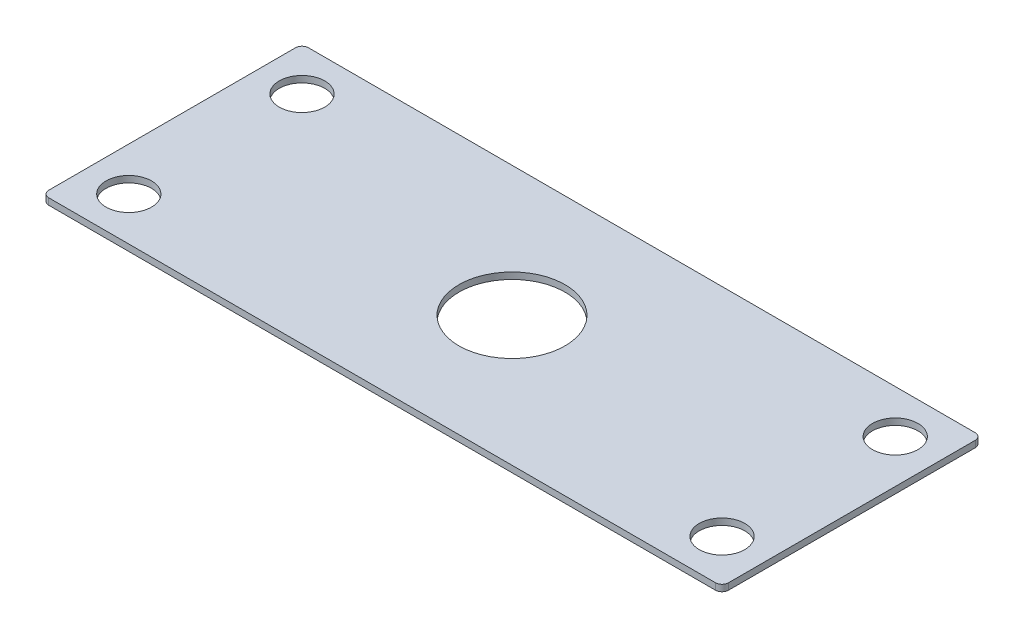
ISO-10303-21;
HEADER;
FILE_DESCRIPTION(('STEP AP214'),'2;1');
FILE_NAME('part.step','',(''),(''),'','','');
FILE_SCHEMA(('AUTOMOTIVE_DESIGN { 1 0 10303 214 1 1 1 1 }'));
ENDSEC;
DATA;
#1=APPLICATION_CONTEXT('core data for automotive mechanical design processes');
#2=APPLICATION_PROTOCOL_DEFINITION('international standard','automotive_design',2000,#1);
#3=PRODUCT_CONTEXT('',#1,'mechanical');
#4=PRODUCT('Part','Part','',(#3));
#5=PRODUCT_RELATED_PRODUCT_CATEGORY('part','',(#4));
#6=PRODUCT_DEFINITION_FORMATION('','',#4);
#7=PRODUCT_DEFINITION_CONTEXT('part definition',#1,'design');
#8=PRODUCT_DEFINITION('design','',#6,#7);
#9=PRODUCT_DEFINITION_SHAPE('','',#8);
#10=(LENGTH_UNIT() NAMED_UNIT(*) SI_UNIT(.MILLI.,.METRE.));
#11=(NAMED_UNIT(*) PLANE_ANGLE_UNIT() SI_UNIT($,.RADIAN.));
#12=(NAMED_UNIT(*) SI_UNIT($,.STERADIAN.) SOLID_ANGLE_UNIT());
#13=UNCERTAINTY_MEASURE_WITH_UNIT(LENGTH_MEASURE(1.E-05),#10,'distance_accuracy_value','');
#14=(GEOMETRIC_REPRESENTATION_CONTEXT(3) GLOBAL_UNCERTAINTY_ASSIGNED_CONTEXT((#13)) GLOBAL_UNIT_ASSIGNED_CONTEXT((#10,
#11,#12)) REPRESENTATION_CONTEXT('',''));
#15=CARTESIAN_POINT('',(0.,0.,0.));
#16=DIRECTION('',(0.,0.,1.));
#17=DIRECTION('',(1.,0.,0.));
#18=AXIS2_PLACEMENT_3D('',#15,#16,#17);
#19=CARTESIAN_POINT('',(-157.,3.,60.));
#20=DIRECTION('',(1.,0.,0.));
#21=DIRECTION('',(0.,0.,1.));
#22=AXIS2_PLACEMENT_3D('',#19,#20,#21);
#23=PLANE('',#22);
#24=DIRECTION('',(0.,0.,1.));
#25=VECTOR('',#24,1.);
#26=CARTESIAN_POINT('',(-157.,3.,60.));
#27=LINE('',#26,#25);
#28=CARTESIAN_POINT('',(-157.,3.,-57.));
#29=VERTEX_POINT('',#28);
#30=CARTESIAN_POINT('',(-157.,3.,57.));
#31=VERTEX_POINT('',#30);
#32=EDGE_CURVE('E141',#29,#31,#27,.T.);
#33=ORIENTED_EDGE('',*,*,#32,.F.);
#34=DIRECTION('',(0.,-1.,0.));
#35=VECTOR('',#34,1.);
#36=CARTESIAN_POINT('',(-157.,3.,-57.));
#37=LINE('',#36,#35);
#38=CARTESIAN_POINT('',(-157.,0.,-57.));
#39=VERTEX_POINT('',#38);
#40=EDGE_CURVE('E11',#29,#39,#37,.T.);
#41=ORIENTED_EDGE('',*,*,#40,.T.);
#42=DIRECTION('',(0.,0.,-1.));
#43=VECTOR('',#42,1.);
#44=CARTESIAN_POINT('',(-157.,0.,0.));
#45=LINE('',#44,#43);
#46=CARTESIAN_POINT('',(-157.,0.,57.));
#47=VERTEX_POINT('',#46);
#48=EDGE_CURVE('E142',#39,#47,#45,.F.);
#49=ORIENTED_EDGE('',*,*,#48,.T.);
#50=DIRECTION('',(0.,-1.,0.));
#51=VECTOR('',#50,1.);
#52=CARTESIAN_POINT('',(-157.,3.,57.));
#53=LINE('',#52,#51);
#54=EDGE_CURVE('E46',#47,#31,#53,.F.);
#55=ORIENTED_EDGE('',*,*,#54,.T.);
#56=EDGE_LOOP('',(#33,#41,#49,#55));
#57=FACE_BOUND('',#56,.T.);
#58=ADVANCED_FACE('F38',(#57),#23,.F.);
#59=CARTESIAN_POINT('',(-157.,3.,60.));
#60=DIRECTION('',(0.,0.,-1.));
#61=DIRECTION('',(1.,0.,0.));
#62=AXIS2_PLACEMENT_3D('',#59,#60,#61);
#63=PLANE('',#62);
#64=DIRECTION('',(1.,0.,0.));
#65=VECTOR('',#64,1.);
#66=CARTESIAN_POINT('',(0.,0.,60.));
#67=LINE('',#66,#65);
#68=CARTESIAN_POINT('',(-154.,0.,60.));
#69=VERTEX_POINT('',#68);
#70=CARTESIAN_POINT('',(154.,0.,60.));
#71=VERTEX_POINT('',#70);
#72=EDGE_CURVE('E173',#69,#71,#67,.T.);
#73=ORIENTED_EDGE('',*,*,#72,.T.);
#74=DIRECTION('',(0.,-1.,0.));
#75=VECTOR('',#74,1.);
#76=CARTESIAN_POINT('',(154.,3.,60.));
#77=LINE('',#76,#75);
#78=CARTESIAN_POINT('',(154.,3.,60.));
#79=VERTEX_POINT('',#78);
#80=EDGE_CURVE('E129',#71,#79,#77,.F.);
#81=ORIENTED_EDGE('',*,*,#80,.T.);
#82=DIRECTION('',(1.,0.,0.));
#83=VECTOR('',#82,1.);
#84=CARTESIAN_POINT('',(-157.,3.,60.));
#85=LINE('',#84,#83);
#86=CARTESIAN_POINT('',(-154.,3.,60.));
#87=VERTEX_POINT('',#86);
#88=EDGE_CURVE('E152',#87,#79,#85,.T.);
#89=ORIENTED_EDGE('',*,*,#88,.F.);
#90=DIRECTION('',(0.,-1.,0.));
#91=VECTOR('',#90,1.);
#92=CARTESIAN_POINT('',(-154.,3.,60.));
#93=LINE('',#92,#91);
#94=EDGE_CURVE('E132',#87,#69,#93,.T.);
#95=ORIENTED_EDGE('',*,*,#94,.T.);
#96=EDGE_LOOP('',(#73,#81,#89,#95));
#97=FACE_BOUND('',#96,.T.);
#98=ADVANCED_FACE('F213',(#97),#63,.F.);
#99=CARTESIAN_POINT('',(157.,3.,60.));
#100=DIRECTION('',(-1.,0.,0.));
#101=DIRECTION('',(0.,0.,-1.));
#102=AXIS2_PLACEMENT_3D('',#99,#100,#101);
#103=PLANE('',#102);
#104=DIRECTION('',(0.,0.,-1.));
#105=VECTOR('',#104,1.);
#106=CARTESIAN_POINT('',(157.,0.,0.));
#107=LINE('',#106,#105);
#108=CARTESIAN_POINT('',(157.,0.,57.));
#109=VERTEX_POINT('',#108);
#110=CARTESIAN_POINT('',(157.,0.,-57.));
#111=VERTEX_POINT('',#110);
#112=EDGE_CURVE('E108',#109,#111,#107,.T.);
#113=ORIENTED_EDGE('',*,*,#112,.T.);
#114=DIRECTION('',(0.,-1.,0.));
#115=VECTOR('',#114,1.);
#116=CARTESIAN_POINT('',(157.,3.,-57.));
#117=LINE('',#116,#115);
#118=CARTESIAN_POINT('',(157.,3.,-57.));
#119=VERTEX_POINT('',#118);
#120=EDGE_CURVE('E114',#111,#119,#117,.F.);
#121=ORIENTED_EDGE('',*,*,#120,.T.);
#122=DIRECTION('',(0.,0.,-1.));
#123=VECTOR('',#122,1.);
#124=CARTESIAN_POINT('',(157.,3.,60.));
#125=LINE('',#124,#123);
#126=CARTESIAN_POINT('',(157.,3.,57.));
#127=VERTEX_POINT('',#126);
#128=EDGE_CURVE('E111',#127,#119,#125,.T.);
#129=ORIENTED_EDGE('',*,*,#128,.F.);
#130=DIRECTION('',(0.,-1.,0.));
#131=VECTOR('',#130,1.);
#132=CARTESIAN_POINT('',(157.,3.,57.));
#133=LINE('',#132,#131);
#134=EDGE_CURVE('E104',#127,#109,#133,.T.);
#135=ORIENTED_EDGE('',*,*,#134,.T.);
#136=EDGE_LOOP('',(#113,#121,#129,#135));
#137=FACE_BOUND('',#136,.T.);
#138=ADVANCED_FACE('F106',(#137),#103,.F.);
#139=CARTESIAN_POINT('',(-157.,3.,-60.));
#140=DIRECTION('',(0.,0.,1.));
#141=DIRECTION('',(-1.,0.,0.));
#142=AXIS2_PLACEMENT_3D('',#139,#140,#141);
#143=PLANE('',#142);
#144=DIRECTION('',(-1.,0.,0.));
#145=VECTOR('',#144,1.);
#146=CARTESIAN_POINT('',(-157.,3.,-60.));
#147=LINE('',#146,#145);
#148=CARTESIAN_POINT('',(154.,3.,-60.));
#149=VERTEX_POINT('',#148);
#150=CARTESIAN_POINT('',(-154.,3.,-60.));
#151=VERTEX_POINT('',#150);
#152=EDGE_CURVE('E153',#149,#151,#147,.T.);
#153=ORIENTED_EDGE('',*,*,#152,.F.);
#154=DIRECTION('',(0.,-1.,0.));
#155=VECTOR('',#154,1.);
#156=CARTESIAN_POINT('',(154.,3.,-60.));
#157=LINE('',#156,#155);
#158=CARTESIAN_POINT('',(154.,0.,-60.));
#159=VERTEX_POINT('',#158);
#160=EDGE_CURVE('E203',#149,#159,#157,.T.);
#161=ORIENTED_EDGE('',*,*,#160,.T.);
#162=DIRECTION('',(1.,0.,0.));
#163=VECTOR('',#162,1.);
#164=CARTESIAN_POINT('',(0.,0.,-60.));
#165=LINE('',#164,#163);
#166=CARTESIAN_POINT('',(-154.,0.,-60.));
#167=VERTEX_POINT('',#166);
#168=EDGE_CURVE('E124',#159,#167,#165,.F.);
#169=ORIENTED_EDGE('',*,*,#168,.T.);
#170=DIRECTION('',(0.,-1.,0.));
#171=VECTOR('',#170,1.);
#172=CARTESIAN_POINT('',(-154.,3.,-60.));
#173=LINE('',#172,#171);
#174=EDGE_CURVE('E200',#167,#151,#173,.F.);
#175=ORIENTED_EDGE('',*,*,#174,.T.);
#176=EDGE_LOOP('',(#153,#161,#169,#175));
#177=FACE_BOUND('',#176,.T.);
#178=ADVANCED_FACE('F207',(#177),#143,.F.);
#179=CARTESIAN_POINT('',(-137.,3.,-40.));
#180=DIRECTION('',(0.,-1.,0.));
#181=DIRECTION('',(0.,0.,-1.));
#182=AXIS2_PLACEMENT_3D('',#179,#180,#181);
#183=CYLINDRICAL_SURFACE('',#182,10.5);
#184=CARTESIAN_POINT('',(-137.,3.,-40.));
#185=DIRECTION('',(0.,1.,0.));
#186=DIRECTION('',(0.,0.,1.));
#187=AXIS2_PLACEMENT_3D('',#184,#185,#186);
#188=CIRCLE('',#187,10.5);
#189=CARTESIAN_POINT('',(-137.,3.,-29.5));
#190=VERTEX_POINT('',#189);
#191=EDGE_CURVE('E155',#190,#190,#188,.T.);
#192=ORIENTED_EDGE('',*,*,#191,.T.);
#193=EDGE_LOOP('',(#192));
#194=FACE_BOUND('',#193,.T.);
#195=CARTESIAN_POINT('',(-137.,0.,-40.));
#196=DIRECTION('',(0.,1.,0.));
#197=DIRECTION('',(0.,0.,1.));
#198=AXIS2_PLACEMENT_3D('',#195,#196,#197);
#199=CIRCLE('',#198,10.5);
#200=CARTESIAN_POINT('',(-137.,0.,-29.5));
#201=VERTEX_POINT('',#200);
#202=EDGE_CURVE('E175',#201,#201,#199,.T.);
#203=ORIENTED_EDGE('',*,*,#202,.F.);
#204=EDGE_LOOP('',(#203));
#205=FACE_BOUND('',#204,.T.);
#206=ADVANCED_FACE('F231',(#194,#205),#183,.F.);
#207=CARTESIAN_POINT('',(137.,3.,-40.));
#208=DIRECTION('',(0.,-1.,0.));
#209=DIRECTION('',(0.,0.,-1.));
#210=AXIS2_PLACEMENT_3D('',#207,#208,#209);
#211=CYLINDRICAL_SURFACE('',#210,10.5);
#212=CARTESIAN_POINT('',(137.,3.,-40.));
#213=DIRECTION('',(0.,1.,0.));
#214=DIRECTION('',(0.,0.,-1.));
#215=AXIS2_PLACEMENT_3D('',#212,#213,#214);
#216=CIRCLE('',#215,10.5);
#217=CARTESIAN_POINT('',(137.,3.,-50.5));
#218=VERTEX_POINT('',#217);
#219=EDGE_CURVE('E162',#218,#218,#216,.T.);
#220=ORIENTED_EDGE('',*,*,#219,.T.);
#221=EDGE_LOOP('',(#220));
#222=FACE_BOUND('',#221,.T.);
#223=CARTESIAN_POINT('',(137.,0.,-40.));
#224=DIRECTION('',(0.,1.,0.));
#225=DIRECTION('',(0.,0.,1.));
#226=AXIS2_PLACEMENT_3D('',#223,#224,#225);
#227=CIRCLE('',#226,10.5);
#228=CARTESIAN_POINT('',(137.,0.,-29.5));
#229=VERTEX_POINT('',#228);
#230=EDGE_CURVE('E181',#229,#229,#227,.T.);
#231=ORIENTED_EDGE('',*,*,#230,.F.);
#232=EDGE_LOOP('',(#231));
#233=FACE_BOUND('',#232,.T.);
#234=ADVANCED_FACE('F234',(#222,#233),#211,.F.);
#235=CARTESIAN_POINT('',(137.,3.,40.));
#236=DIRECTION('',(0.,-1.,0.));
#237=DIRECTION('',(0.,0.,-1.));
#238=AXIS2_PLACEMENT_3D('',#235,#236,#237);
#239=CYLINDRICAL_SURFACE('',#238,10.5);
#240=CARTESIAN_POINT('',(137.,3.,40.));
#241=DIRECTION('',(0.,1.,0.));
#242=DIRECTION('',(0.,0.,1.));
#243=AXIS2_PLACEMENT_3D('',#240,#241,#242);
#244=CIRCLE('',#243,10.5);
#245=CARTESIAN_POINT('',(137.,3.,50.5000000000001));
#246=VERTEX_POINT('',#245);
#247=EDGE_CURVE('E165',#246,#246,#244,.T.);
#248=ORIENTED_EDGE('',*,*,#247,.T.);
#249=EDGE_LOOP('',(#248));
#250=FACE_BOUND('',#249,.T.);
#251=CARTESIAN_POINT('',(137.,0.,40.));
#252=DIRECTION('',(0.,1.,0.));
#253=DIRECTION('',(0.,0.,1.));
#254=AXIS2_PLACEMENT_3D('',#251,#252,#253);
#255=CIRCLE('',#254,10.5);
#256=CARTESIAN_POINT('',(137.,0.,50.5000000000001));
#257=VERTEX_POINT('',#256);
#258=EDGE_CURVE('E184',#257,#257,#255,.T.);
#259=ORIENTED_EDGE('',*,*,#258,.F.);
#260=EDGE_LOOP('',(#259));
#261=FACE_BOUND('',#260,.T.);
#262=ADVANCED_FACE('F238',(#250,#261),#239,.F.);
#263=CARTESIAN_POINT('',(0.,3.,0.));
#264=DIRECTION('',(0.,-1.,0.));
#265=DIRECTION('',(0.,0.,-1.));
#266=AXIS2_PLACEMENT_3D('',#263,#264,#265);
#267=CYLINDRICAL_SURFACE('',#266,24.5);
#268=CARTESIAN_POINT('',(0.,3.,0.));
#269=DIRECTION('',(0.,1.,0.));
#270=DIRECTION('',(0.,0.,1.));
#271=AXIS2_PLACEMENT_3D('',#268,#269,#270);
#272=CIRCLE('',#271,24.5);
#273=CARTESIAN_POINT('',(0.,3.,24.5));
#274=VERTEX_POINT('',#273);
#275=EDGE_CURVE('E168',#274,#274,#272,.T.);
#276=ORIENTED_EDGE('',*,*,#275,.T.);
#277=EDGE_LOOP('',(#276));
#278=FACE_BOUND('',#277,.T.);
#279=CARTESIAN_POINT('',(0.,0.,0.));
#280=DIRECTION('',(0.,1.,0.));
#281=DIRECTION('',(0.,0.,1.));
#282=AXIS2_PLACEMENT_3D('',#279,#280,#281);
#283=CIRCLE('',#282,24.5);
#284=CARTESIAN_POINT('',(0.,0.,24.5));
#285=VERTEX_POINT('',#284);
#286=EDGE_CURVE('E187',#285,#285,#283,.T.);
#287=ORIENTED_EDGE('',*,*,#286,.F.);
#288=EDGE_LOOP('',(#287));
#289=FACE_BOUND('',#288,.T.);
#290=ADVANCED_FACE('F242',(#278,#289),#267,.F.);
#291=CARTESIAN_POINT('',(-137.,3.,40.));
#292=DIRECTION('',(0.,-1.,0.));
#293=DIRECTION('',(0.,0.,-1.));
#294=AXIS2_PLACEMENT_3D('',#291,#292,#293);
#295=CYLINDRICAL_SURFACE('',#294,10.5);
#296=CARTESIAN_POINT('',(-137.,3.,40.));
#297=DIRECTION('',(0.,1.,0.));
#298=DIRECTION('',(0.,0.,-1.));
#299=AXIS2_PLACEMENT_3D('',#296,#297,#298);
#300=CIRCLE('',#299,10.5);
#301=CARTESIAN_POINT('',(-137.,3.,29.5));
#302=VERTEX_POINT('',#301);
#303=EDGE_CURVE('E115',#302,#302,#300,.T.);
#304=ORIENTED_EDGE('',*,*,#303,.T.);
#305=EDGE_LOOP('',(#304));
#306=FACE_BOUND('',#305,.T.);
#307=CARTESIAN_POINT('',(-137.,0.,40.));
#308=DIRECTION('',(0.,1.,0.));
#309=DIRECTION('',(0.,0.,1.));
#310=AXIS2_PLACEMENT_3D('',#307,#308,#309);
#311=CIRCLE('',#310,10.5);
#312=CARTESIAN_POINT('',(-137.,0.,50.5000000000001));
#313=VERTEX_POINT('',#312);
#314=EDGE_CURVE('E190',#313,#313,#311,.T.);
#315=ORIENTED_EDGE('',*,*,#314,.F.);
#316=EDGE_LOOP('',(#315));
#317=FACE_BOUND('',#316,.T.);
#318=ADVANCED_FACE('F246',(#306,#317),#295,.F.);
#319=CARTESIAN_POINT('',(0.,3.,0.));
#320=DIRECTION('',(0.,-1.,0.));
#321=DIRECTION('',(0.,0.,-1.));
#322=AXIS2_PLACEMENT_3D('',#319,#320,#321);
#323=PLANE('',#322);
#324=ORIENTED_EDGE('',*,*,#128,.T.);
#325=CARTESIAN_POINT('',(154.,3.,-57.));
#326=DIRECTION('',(0.,-1.,0.));
#327=DIRECTION('',(0.,0.,-1.));
#328=AXIS2_PLACEMENT_3D('',#325,#326,#327);
#329=CIRCLE('',#328,3.);
#330=EDGE_CURVE('E198',#119,#149,#329,.F.);
#331=ORIENTED_EDGE('',*,*,#330,.T.);
#332=ORIENTED_EDGE('',*,*,#152,.T.);
#333=CARTESIAN_POINT('',(-154.,3.,-57.));
#334=DIRECTION('',(0.,-1.,0.));
#335=DIRECTION('',(0.,0.,-1.));
#336=AXIS2_PLACEMENT_3D('',#333,#334,#335);
#337=CIRCLE('',#336,3.);
#338=EDGE_CURVE('E151',#151,#29,#337,.F.);
#339=ORIENTED_EDGE('',*,*,#338,.T.);
#340=ORIENTED_EDGE('',*,*,#32,.T.);
#341=CARTESIAN_POINT('',(-154.,3.,57.));
#342=DIRECTION('',(0.,-1.,0.));
#343=DIRECTION('',(0.,0.,-1.));
#344=AXIS2_PLACEMENT_3D('',#341,#342,#343);
#345=CIRCLE('',#344,3.);
#346=EDGE_CURVE('E148',#31,#87,#345,.F.);
#347=ORIENTED_EDGE('',*,*,#346,.T.);
#348=ORIENTED_EDGE('',*,*,#88,.T.);
#349=CARTESIAN_POINT('',(154.,3.,57.));
#350=DIRECTION('',(0.,-1.,0.));
#351=DIRECTION('',(0.,0.,-1.));
#352=AXIS2_PLACEMENT_3D('',#349,#350,#351);
#353=CIRCLE('',#352,3.);
#354=EDGE_CURVE('E196',#79,#127,#353,.F.);
#355=ORIENTED_EDGE('',*,*,#354,.T.);
#356=EDGE_LOOP('',(#324,#331,#332,#339,#340,#347,#348,#355));
#357=FACE_BOUND('',#356,.T.);
#358=ORIENTED_EDGE('',*,*,#191,.F.);
#359=EDGE_LOOP('',(#358));
#360=FACE_BOUND('',#359,.T.);
#361=ORIENTED_EDGE('',*,*,#219,.F.);
#362=EDGE_LOOP('',(#361));
#363=FACE_BOUND('',#362,.T.);
#364=ORIENTED_EDGE('',*,*,#247,.F.);
#365=EDGE_LOOP('',(#364));
#366=FACE_BOUND('',#365,.T.);
#367=ORIENTED_EDGE('',*,*,#275,.F.);
#368=EDGE_LOOP('',(#367));
#369=FACE_BOUND('',#368,.T.);
#370=ORIENTED_EDGE('',*,*,#303,.F.);
#371=EDGE_LOOP('',(#370));
#372=FACE_BOUND('',#371,.T.);
#373=ADVANCED_FACE('F145',(#357,#360,#363,#366,#369,#372),#323,.F.);
#374=CARTESIAN_POINT('',(0.,0.,0.));
#375=DIRECTION('',(0.,-1.,0.));
#376=DIRECTION('',(0.,0.,-1.));
#377=AXIS2_PLACEMENT_3D('',#374,#375,#376);
#378=PLANE('',#377);
#379=ORIENTED_EDGE('',*,*,#168,.F.);
#380=CARTESIAN_POINT('',(154.,0.,-57.));
#381=DIRECTION('',(0.,-1.,0.));
#382=DIRECTION('',(0.,0.,-1.));
#383=AXIS2_PLACEMENT_3D('',#380,#381,#382);
#384=CIRCLE('',#383,3.);
#385=EDGE_CURVE('E123',#159,#111,#384,.T.);
#386=ORIENTED_EDGE('',*,*,#385,.T.);
#387=ORIENTED_EDGE('',*,*,#112,.F.);
#388=CARTESIAN_POINT('',(154.,0.,57.));
#389=DIRECTION('',(0.,-1.,0.));
#390=DIRECTION('',(0.,0.,-1.));
#391=AXIS2_PLACEMENT_3D('',#388,#389,#390);
#392=CIRCLE('',#391,3.);
#393=EDGE_CURVE('E120',#109,#71,#392,.T.);
#394=ORIENTED_EDGE('',*,*,#393,.T.);
#395=ORIENTED_EDGE('',*,*,#72,.F.);
#396=CARTESIAN_POINT('',(-154.,0.,57.));
#397=DIRECTION('',(0.,-1.,0.));
#398=DIRECTION('',(0.,0.,-1.));
#399=AXIS2_PLACEMENT_3D('',#396,#397,#398);
#400=CIRCLE('',#399,3.);
#401=EDGE_CURVE('E53',#69,#47,#400,.T.);
#402=ORIENTED_EDGE('',*,*,#401,.T.);
#403=ORIENTED_EDGE('',*,*,#48,.F.);
#404=CARTESIAN_POINT('',(-154.,0.,-57.));
#405=DIRECTION('',(0.,-1.,0.));
#406=DIRECTION('',(0.,0.,-1.));
#407=AXIS2_PLACEMENT_3D('',#404,#405,#406);
#408=CIRCLE('',#407,3.);
#409=EDGE_CURVE('E130',#39,#167,#408,.T.);
#410=ORIENTED_EDGE('',*,*,#409,.T.);
#411=EDGE_LOOP('',(#379,#386,#387,#394,#395,#402,#403,#410));
#412=FACE_BOUND('',#411,.T.);
#413=ORIENTED_EDGE('',*,*,#202,.T.);
#414=EDGE_LOOP('',(#413));
#415=FACE_BOUND('',#414,.T.);
#416=ORIENTED_EDGE('',*,*,#230,.T.);
#417=EDGE_LOOP('',(#416));
#418=FACE_BOUND('',#417,.T.);
#419=ORIENTED_EDGE('',*,*,#258,.T.);
#420=EDGE_LOOP('',(#419));
#421=FACE_BOUND('',#420,.T.);
#422=ORIENTED_EDGE('',*,*,#286,.T.);
#423=EDGE_LOOP('',(#422));
#424=FACE_BOUND('',#423,.T.);
#425=ORIENTED_EDGE('',*,*,#314,.T.);
#426=EDGE_LOOP('',(#425));
#427=FACE_BOUND('',#426,.T.);
#428=ADVANCED_FACE('F118',(#412,#415,#418,#421,#424,#427),#378,.T.);
#429=CARTESIAN_POINT('',(154.,3.,-57.));
#430=DIRECTION('',(0.,1.,0.));
#431=DIRECTION('',(0.,0.,1.));
#432=AXIS2_PLACEMENT_3D('',#429,#430,#431);
#433=CYLINDRICAL_SURFACE('',#432,3.);
#434=ORIENTED_EDGE('',*,*,#385,.F.);
#435=ORIENTED_EDGE('',*,*,#160,.F.);
#436=ORIENTED_EDGE('',*,*,#330,.F.);
#437=ORIENTED_EDGE('',*,*,#120,.F.);
#438=EDGE_LOOP('',(#434,#435,#436,#437));
#439=FACE_BOUND('',#438,.T.);
#440=ADVANCED_FACE('F211',(#439),#433,.T.);
#441=CARTESIAN_POINT('',(154.,3.,57.));
#442=DIRECTION('',(0.,1.,0.));
#443=DIRECTION('',(0.,0.,1.));
#444=AXIS2_PLACEMENT_3D('',#441,#442,#443);
#445=CYLINDRICAL_SURFACE('',#444,3.);
#446=ORIENTED_EDGE('',*,*,#393,.F.);
#447=ORIENTED_EDGE('',*,*,#134,.F.);
#448=ORIENTED_EDGE('',*,*,#354,.F.);
#449=ORIENTED_EDGE('',*,*,#80,.F.);
#450=EDGE_LOOP('',(#446,#447,#448,#449));
#451=FACE_BOUND('',#450,.T.);
#452=ADVANCED_FACE('F127',(#451),#445,.T.);
#453=CARTESIAN_POINT('',(-154.,3.,-57.));
#454=DIRECTION('',(0.,1.,0.));
#455=DIRECTION('',(0.,0.,1.));
#456=AXIS2_PLACEMENT_3D('',#453,#454,#455);
#457=CYLINDRICAL_SURFACE('',#456,3.);
#458=ORIENTED_EDGE('',*,*,#409,.F.);
#459=ORIENTED_EDGE('',*,*,#40,.F.);
#460=ORIENTED_EDGE('',*,*,#338,.F.);
#461=ORIENTED_EDGE('',*,*,#174,.F.);
#462=EDGE_LOOP('',(#458,#459,#460,#461));
#463=FACE_BOUND('',#462,.T.);
#464=ADVANCED_FACE('F216',(#463),#457,.T.);
#465=CARTESIAN_POINT('',(-154.,3.,57.));
#466=DIRECTION('',(0.,1.,0.));
#467=DIRECTION('',(0.,0.,1.));
#468=AXIS2_PLACEMENT_3D('',#465,#466,#467);
#469=CYLINDRICAL_SURFACE('',#468,3.);
#470=ORIENTED_EDGE('',*,*,#401,.F.);
#471=ORIENTED_EDGE('',*,*,#94,.F.);
#472=ORIENTED_EDGE('',*,*,#346,.F.);
#473=ORIENTED_EDGE('',*,*,#54,.F.);
#474=EDGE_LOOP('',(#470,#471,#472,#473));
#475=FACE_BOUND('',#474,.T.);
#476=ADVANCED_FACE('F40',(#475),#469,.T.);
#477=CLOSED_SHELL('',(#58,#98,#138,#178,#206,#234,#262,#290,#318,#373,#428,#440,#452,#464,#476));
#478=MANIFOLD_SOLID_BREP('B2',#477);
#479=ADVANCED_BREP_SHAPE_REPRESENTATION('',(#18,#478),#14);
#480=SHAPE_DEFINITION_REPRESENTATION(#9,#479);
ENDSEC;
END-ISO-10303-21;
